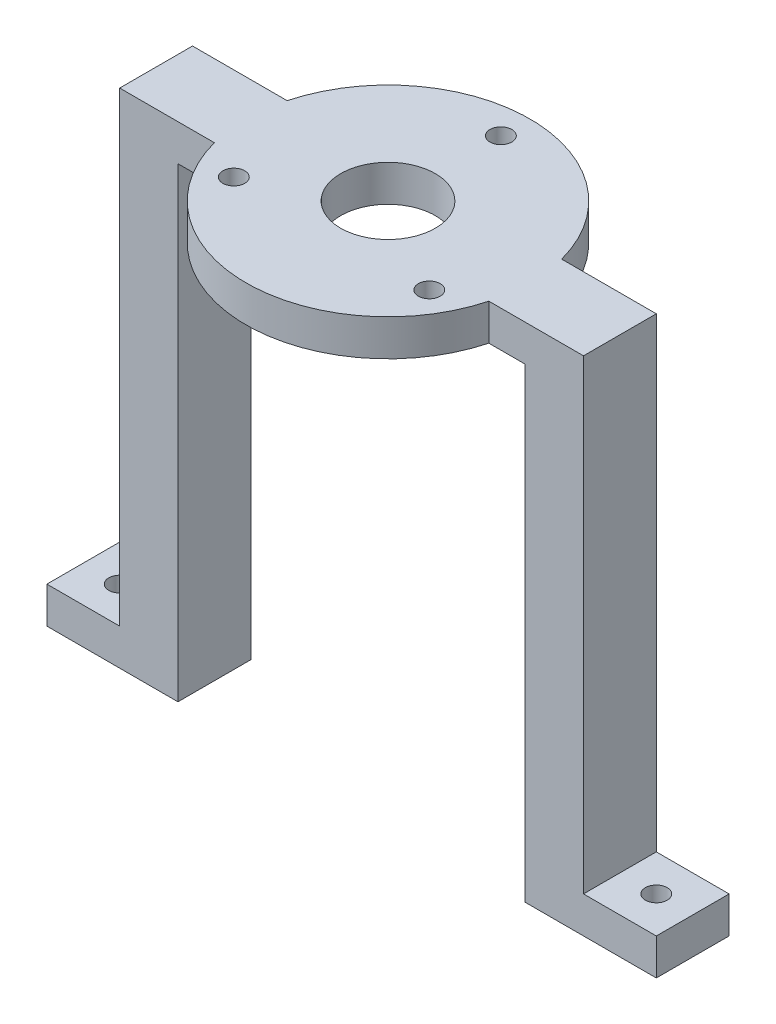
ISO-10303-21;
HEADER;
FILE_DESCRIPTION(('STEP AP214'),'2;1');
FILE_NAME('part.step','',(''),(''),'','','');
FILE_SCHEMA(('AUTOMOTIVE_DESIGN { 1 0 10303 214 1 1 1 1 }'));
ENDSEC;
DATA;
#1=APPLICATION_CONTEXT('core data for automotive mechanical design processes');
#2=APPLICATION_PROTOCOL_DEFINITION('international standard','automotive_design',2000,#1);
#3=PRODUCT_CONTEXT('',#1,'mechanical');
#4=PRODUCT('Part','Part','',(#3));
#5=PRODUCT_RELATED_PRODUCT_CATEGORY('part','',(#4));
#6=PRODUCT_DEFINITION_FORMATION('','',#4);
#7=PRODUCT_DEFINITION_CONTEXT('part definition',#1,'design');
#8=PRODUCT_DEFINITION('design','',#6,#7);
#9=PRODUCT_DEFINITION_SHAPE('','',#8);
#10=(LENGTH_UNIT() NAMED_UNIT(*) SI_UNIT(.MILLI.,.METRE.));
#11=(NAMED_UNIT(*) PLANE_ANGLE_UNIT() SI_UNIT($,.RADIAN.));
#12=(NAMED_UNIT(*) SI_UNIT($,.STERADIAN.) SOLID_ANGLE_UNIT());
#13=UNCERTAINTY_MEASURE_WITH_UNIT(LENGTH_MEASURE(1.E-05),#10,'distance_accuracy_value','');
#14=(GEOMETRIC_REPRESENTATION_CONTEXT(3) GLOBAL_UNCERTAINTY_ASSIGNED_CONTEXT((#13)) GLOBAL_UNIT_ASSIGNED_CONTEXT((#10,
#11,#12)) REPRESENTATION_CONTEXT('',''));
#15=CARTESIAN_POINT('',(0.,0.,0.));
#16=DIRECTION('',(0.,0.,1.));
#17=DIRECTION('',(1.,0.,0.));
#18=AXIS2_PLACEMENT_3D('',#15,#16,#17);
#19=CARTESIAN_POINT('',(31.8480768249708,5.,5.));
#20=DIRECTION('',(-1.,0.,0.));
#21=DIRECTION('',(0.,0.,1.));
#22=AXIS2_PLACEMENT_3D('',#19,#20,#21);
#23=PLANE('',#22);
#24=DIRECTION('',(0.,0.,1.));
#25=VECTOR('',#24,1.);
#26=CARTESIAN_POINT('',(31.8480768249708,-59.,5.));
#27=LINE('',#26,#25);
#28=CARTESIAN_POINT('',(31.8480768249708,-59.,-5.));
#29=VERTEX_POINT('',#28);
#30=CARTESIAN_POINT('',(31.8480768249708,-59.,5.));
#31=VERTEX_POINT('',#30);
#32=EDGE_CURVE('E55',#29,#31,#27,.T.);
#33=ORIENTED_EDGE('',*,*,#32,.F.);
#34=DIRECTION('',(0.,-1.,0.));
#35=VECTOR('',#34,1.);
#36=CARTESIAN_POINT('',(31.8480768249708,5.,-5.));
#37=LINE('',#36,#35);
#38=CARTESIAN_POINT('',(31.8480768249708,5.,-5.));
#39=VERTEX_POINT('',#38);
#40=EDGE_CURVE('E316',#39,#29,#37,.T.);
#41=ORIENTED_EDGE('',*,*,#40,.F.);
#42=DIRECTION('',(0.,0.,-1.));
#43=VECTOR('',#42,1.);
#44=CARTESIAN_POINT('',(31.8480768249708,5.,5.));
#45=LINE('',#44,#43);
#46=CARTESIAN_POINT('',(31.8480768249708,5.,5.));
#47=VERTEX_POINT('',#46);
#48=EDGE_CURVE('E288',#47,#39,#45,.T.);
#49=ORIENTED_EDGE('',*,*,#48,.F.);
#50=DIRECTION('',(0.,-1.,0.));
#51=VECTOR('',#50,1.);
#52=CARTESIAN_POINT('',(31.8480768249708,5.,5.));
#53=LINE('',#52,#51);
#54=EDGE_CURVE('E319',#47,#31,#53,.T.);
#55=ORIENTED_EDGE('',*,*,#54,.T.);
#56=EDGE_LOOP('',(#33,#41,#49,#55));
#57=FACE_BOUND('',#56,.T.);
#58=ADVANCED_FACE('F39',(#57),#23,.F.);
#59=CARTESIAN_POINT('',(-31.8480768249708,5.,5.));
#60=DIRECTION('',(1.,0.,0.));
#61=DIRECTION('',(0.,0.,-1.));
#62=AXIS2_PLACEMENT_3D('',#59,#60,#61);
#63=PLANE('',#62);
#64=DIRECTION('',(0.,0.,-1.));
#65=VECTOR('',#64,1.);
#66=CARTESIAN_POINT('',(-31.8480768249708,-59.,-5.));
#67=LINE('',#66,#65);
#68=CARTESIAN_POINT('',(-31.8480768249708,-59.,5.));
#69=VERTEX_POINT('',#68);
#70=CARTESIAN_POINT('',(-31.8480768249708,-59.,-5.));
#71=VERTEX_POINT('',#70);
#72=EDGE_CURVE('E63',#69,#71,#67,.T.);
#73=ORIENTED_EDGE('',*,*,#72,.F.);
#74=DIRECTION('',(0.,-1.,0.));
#75=VECTOR('',#74,1.);
#76=CARTESIAN_POINT('',(-31.8480768249708,5.,5.));
#77=LINE('',#76,#75);
#78=CARTESIAN_POINT('',(-31.8480768249708,5.,5.));
#79=VERTEX_POINT('',#78);
#80=EDGE_CURVE('E330',#79,#69,#77,.T.);
#81=ORIENTED_EDGE('',*,*,#80,.F.);
#82=DIRECTION('',(0.,0.,1.));
#83=VECTOR('',#82,1.);
#84=CARTESIAN_POINT('',(-31.8480768249708,5.,5.));
#85=LINE('',#84,#83);
#86=CARTESIAN_POINT('',(-31.8480768249708,5.,-5.));
#87=VERTEX_POINT('',#86);
#88=EDGE_CURVE('E276',#87,#79,#85,.T.);
#89=ORIENTED_EDGE('',*,*,#88,.F.);
#90=DIRECTION('',(0.,-1.,0.));
#91=VECTOR('',#90,1.);
#92=CARTESIAN_POINT('',(-31.8480768249708,5.,-5.));
#93=LINE('',#92,#91);
#94=EDGE_CURVE('E48',#87,#71,#93,.T.);
#95=ORIENTED_EDGE('',*,*,#94,.T.);
#96=EDGE_LOOP('',(#73,#81,#89,#95));
#97=FACE_BOUND('',#96,.T.);
#98=ADVANCED_FACE('F335',(#97),#63,.F.);
#99=CARTESIAN_POINT('',(0.,0.,0.));
#100=DIRECTION('',(0.,1.,0.));
#101=DIRECTION('',(0.,0.,1.));
#102=AXIS2_PLACEMENT_3D('',#99,#100,#101);
#103=PLANE('',#102);
#104=CARTESIAN_POINT('',(0.,0.,-15.5));
#105=DIRECTION('',(0.,1.,0.));
#106=DIRECTION('',(0.,0.,1.));
#107=AXIS2_PLACEMENT_3D('',#104,#105,#106);
#108=CIRCLE('',#107,1.49999999999999);
#109=CARTESIAN_POINT('',(0.,0.,-14.));
#110=VERTEX_POINT('',#109);
#111=EDGE_CURVE('E492',#110,#110,#108,.T.);
#112=ORIENTED_EDGE('',*,*,#111,.T.);
#113=EDGE_LOOP('',(#112));
#114=FACE_BOUND('',#113,.T.);
#115=CARTESIAN_POINT('',(13.4233937586598,0.,7.74999999999943));
#116=DIRECTION('',(0.,1.,0.));
#117=DIRECTION('',(0.,0.,1.));
#118=AXIS2_PLACEMENT_3D('',#115,#116,#117);
#119=CIRCLE('',#118,1.49999999999999);
#120=CARTESIAN_POINT('',(13.4233937586598,0.,9.24999999999942));
#121=VERTEX_POINT('',#120);
#122=EDGE_CURVE('E484',#121,#121,#119,.T.);
#123=ORIENTED_EDGE('',*,*,#122,.T.);
#124=EDGE_LOOP('',(#123));
#125=FACE_BOUND('',#124,.T.);
#126=CARTESIAN_POINT('',(-13.4233937586578,0.,7.75000000000057));
#127=DIRECTION('',(0.,1.,0.));
#128=DIRECTION('',(0.,0.,1.));
#129=AXIS2_PLACEMENT_3D('',#126,#127,#128);
#130=CIRCLE('',#129,1.49999999999999);
#131=CARTESIAN_POINT('',(-13.4233937586578,0.,9.25000000000055));
#132=VERTEX_POINT('',#131);
#133=EDGE_CURVE('E474',#132,#132,#130,.T.);
#134=ORIENTED_EDGE('',*,*,#133,.T.);
#135=EDGE_LOOP('',(#134));
#136=FACE_BOUND('',#135,.T.);
#137=CARTESIAN_POINT('',(0.,0.,0.));
#138=DIRECTION('',(0.,1.,0.));
#139=DIRECTION('',(0.,0.,1.));
#140=AXIS2_PLACEMENT_3D('',#137,#138,#139);
#141=CIRCLE('',#140,6.5);
#142=CARTESIAN_POINT('',(0.,0.,6.5));
#143=VERTEX_POINT('',#142);
#144=EDGE_CURVE('E259',#143,#143,#141,.T.);
#145=ORIENTED_EDGE('',*,*,#144,.T.);
#146=EDGE_LOOP('',(#145));
#147=FACE_BOUND('',#146,.T.);
#148=DIRECTION('',(0.,0.,-1.));
#149=VECTOR('',#148,1.);
#150=CARTESIAN_POINT('',(23.8480768249708,0.,5.));
#151=LINE('',#150,#149);
#152=CARTESIAN_POINT('',(23.8480768249708,0.,5.));
#153=VERTEX_POINT('',#152);
#154=CARTESIAN_POINT('',(23.8480768249708,0.,-5.));
#155=VERTEX_POINT('',#154);
#156=EDGE_CURVE('E167',#153,#155,#151,.T.);
#157=ORIENTED_EDGE('',*,*,#156,.F.);
#158=DIRECTION('',(1.,0.,0.));
#159=VECTOR('',#158,1.);
#160=CARTESIAN_POINT('',(31.8480768249708,0.,5.));
#161=LINE('',#160,#159);
#162=CARTESIAN_POINT('',(18.8480768249708,0.,5.00000000000001));
#163=VERTEX_POINT('',#162);
#164=EDGE_CURVE('E308',#163,#153,#161,.T.);
#165=ORIENTED_EDGE('',*,*,#164,.F.);
#166=CARTESIAN_POINT('',(0.,0.,0.));
#167=DIRECTION('',(0.,1.,0.));
#168=DIRECTION('',(0.,0.,1.));
#169=AXIS2_PLACEMENT_3D('',#166,#167,#168);
#170=CIRCLE('',#169,19.5);
#171=CARTESIAN_POINT('',(-18.8480768249708,0.,5.));
#172=VERTEX_POINT('',#171);
#173=EDGE_CURVE('E305',#172,#163,#170,.T.);
#174=ORIENTED_EDGE('',*,*,#173,.F.);
#175=DIRECTION('',(1.,0.,0.));
#176=VECTOR('',#175,1.);
#177=CARTESIAN_POINT('',(-31.8480768249708,0.,5.));
#178=LINE('',#177,#176);
#179=CARTESIAN_POINT('',(-23.8480768249708,0.,5.));
#180=VERTEX_POINT('',#179);
#181=EDGE_CURVE('E302',#180,#172,#178,.T.);
#182=ORIENTED_EDGE('',*,*,#181,.F.);
#183=DIRECTION('',(0.,0.,1.));
#184=VECTOR('',#183,1.);
#185=CARTESIAN_POINT('',(-23.8480768249708,0.,5.));
#186=LINE('',#185,#184);
#187=CARTESIAN_POINT('',(-23.8480768249708,0.,-5.));
#188=VERTEX_POINT('',#187);
#189=EDGE_CURVE('E238',#188,#180,#186,.T.);
#190=ORIENTED_EDGE('',*,*,#189,.F.);
#191=DIRECTION('',(-1.,0.,0.));
#192=VECTOR('',#191,1.);
#193=CARTESIAN_POINT('',(-31.8480768249708,0.,-5.));
#194=LINE('',#193,#192);
#195=CARTESIAN_POINT('',(-18.8480768249708,0.,-5.));
#196=VERTEX_POINT('',#195);
#197=EDGE_CURVE('E298',#196,#188,#194,.T.);
#198=ORIENTED_EDGE('',*,*,#197,.F.);
#199=CARTESIAN_POINT('',(0.,0.,0.));
#200=DIRECTION('',(0.,1.,0.));
#201=DIRECTION('',(0.,0.,1.));
#202=AXIS2_PLACEMENT_3D('',#199,#200,#201);
#203=CIRCLE('',#202,19.5);
#204=CARTESIAN_POINT('',(18.8480768249708,0.,-5.));
#205=VERTEX_POINT('',#204);
#206=EDGE_CURVE('E264',#205,#196,#203,.T.);
#207=ORIENTED_EDGE('',*,*,#206,.F.);
#208=DIRECTION('',(-1.,0.,0.));
#209=VECTOR('',#208,1.);
#210=CARTESIAN_POINT('',(31.8480768249708,0.,-5.));
#211=LINE('',#210,#209);
#212=EDGE_CURVE('E273',#155,#205,#211,.T.);
#213=ORIENTED_EDGE('',*,*,#212,.F.);
#214=EDGE_LOOP('',(#157,#165,#174,#182,#190,#198,#207,#213));
#215=FACE_BOUND('',#214,.T.);
#216=ADVANCED_FACE('F367',(#114,#125,#136,#147,#215),#103,.F.);
#217=CARTESIAN_POINT('',(0.,5.,0.));
#218=DIRECTION('',(0.,1.,0.));
#219=DIRECTION('',(0.,0.,1.));
#220=AXIS2_PLACEMENT_3D('',#217,#218,#219);
#221=PLANE('',#220);
#222=CARTESIAN_POINT('',(0.,5.,-15.5));
#223=DIRECTION('',(0.,1.,0.));
#224=DIRECTION('',(0.,0.,1.));
#225=AXIS2_PLACEMENT_3D('',#222,#223,#224);
#226=CIRCLE('',#225,1.49999999999999);
#227=CARTESIAN_POINT('',(0.,5.,-14.));
#228=VERTEX_POINT('',#227);
#229=EDGE_CURVE('E496',#228,#228,#226,.T.);
#230=ORIENTED_EDGE('',*,*,#229,.F.);
#231=EDGE_LOOP('',(#230));
#232=FACE_BOUND('',#231,.T.);
#233=CARTESIAN_POINT('',(13.4233937586598,5.,7.74999999999943));
#234=DIRECTION('',(0.,1.,0.));
#235=DIRECTION('',(0.,0.,1.));
#236=AXIS2_PLACEMENT_3D('',#233,#234,#235);
#237=CIRCLE('',#236,1.49999999999999);
#238=CARTESIAN_POINT('',(13.4233937586598,5.,9.24999999999942));
#239=VERTEX_POINT('',#238);
#240=EDGE_CURVE('E488',#239,#239,#237,.T.);
#241=ORIENTED_EDGE('',*,*,#240,.F.);
#242=EDGE_LOOP('',(#241));
#243=FACE_BOUND('',#242,.T.);
#244=CARTESIAN_POINT('',(-13.4233937586578,5.,7.75000000000057));
#245=DIRECTION('',(0.,1.,0.));
#246=DIRECTION('',(0.,0.,1.));
#247=AXIS2_PLACEMENT_3D('',#244,#245,#246);
#248=CIRCLE('',#247,1.49999999999999);
#249=CARTESIAN_POINT('',(-13.4233937586578,5.,9.25000000000055));
#250=VERTEX_POINT('',#249);
#251=EDGE_CURVE('E480',#250,#250,#248,.T.);
#252=ORIENTED_EDGE('',*,*,#251,.F.);
#253=EDGE_LOOP('',(#252));
#254=FACE_BOUND('',#253,.T.);
#255=CARTESIAN_POINT('',(0.,5.,0.));
#256=DIRECTION('',(0.,1.,0.));
#257=DIRECTION('',(0.,0.,1.));
#258=AXIS2_PLACEMENT_3D('',#255,#256,#257);
#259=CIRCLE('',#258,19.5);
#260=CARTESIAN_POINT('',(18.8480768249708,5.,-5.));
#261=VERTEX_POINT('',#260);
#262=CARTESIAN_POINT('',(-18.8480768249708,5.,-5.));
#263=VERTEX_POINT('',#262);
#264=EDGE_CURVE('E268',#261,#263,#259,.T.);
#265=ORIENTED_EDGE('',*,*,#264,.T.);
#266=DIRECTION('',(-1.,0.,0.));
#267=VECTOR('',#266,1.);
#268=CARTESIAN_POINT('',(-31.8480768249708,5.,-5.));
#269=LINE('',#268,#267);
#270=EDGE_CURVE('E272',#263,#87,#269,.T.);
#271=ORIENTED_EDGE('',*,*,#270,.T.);
#272=ORIENTED_EDGE('',*,*,#88,.T.);
#273=DIRECTION('',(1.,0.,0.));
#274=VECTOR('',#273,1.);
#275=CARTESIAN_POINT('',(-31.8480768249708,5.,5.));
#276=LINE('',#275,#274);
#277=CARTESIAN_POINT('',(-18.8480768249708,5.,5.));
#278=VERTEX_POINT('',#277);
#279=EDGE_CURVE('E279',#79,#278,#276,.T.);
#280=ORIENTED_EDGE('',*,*,#279,.T.);
#281=CARTESIAN_POINT('',(0.,5.,0.));
#282=DIRECTION('',(0.,1.,0.));
#283=DIRECTION('',(0.,0.,1.));
#284=AXIS2_PLACEMENT_3D('',#281,#282,#283);
#285=CIRCLE('',#284,19.5);
#286=CARTESIAN_POINT('',(18.8480768249708,5.,5.00000000000001));
#287=VERTEX_POINT('',#286);
#288=EDGE_CURVE('E282',#278,#287,#285,.T.);
#289=ORIENTED_EDGE('',*,*,#288,.T.);
#290=DIRECTION('',(1.,0.,0.));
#291=VECTOR('',#290,1.);
#292=CARTESIAN_POINT('',(31.8480768249708,5.,5.));
#293=LINE('',#292,#291);
#294=EDGE_CURVE('E285',#287,#47,#293,.T.);
#295=ORIENTED_EDGE('',*,*,#294,.T.);
#296=ORIENTED_EDGE('',*,*,#48,.T.);
#297=DIRECTION('',(-1.,0.,0.));
#298=VECTOR('',#297,1.);
#299=CARTESIAN_POINT('',(31.8480768249708,5.,-5.));
#300=LINE('',#299,#298);
#301=EDGE_CURVE('E291',#39,#261,#300,.T.);
#302=ORIENTED_EDGE('',*,*,#301,.T.);
#303=EDGE_LOOP('',(#265,#271,#272,#280,#289,#295,#296,#302));
#304=FACE_BOUND('',#303,.T.);
#305=CARTESIAN_POINT('',(0.,5.,0.));
#306=DIRECTION('',(0.,1.,0.));
#307=DIRECTION('',(0.,0.,1.));
#308=AXIS2_PLACEMENT_3D('',#305,#306,#307);
#309=CIRCLE('',#308,6.5);
#310=CARTESIAN_POINT('',(0.,5.,6.5));
#311=VERTEX_POINT('',#310);
#312=EDGE_CURVE('E260',#311,#311,#309,.T.);
#313=ORIENTED_EDGE('',*,*,#312,.F.);
#314=EDGE_LOOP('',(#313));
#315=FACE_BOUND('',#314,.T.);
#316=ADVANCED_FACE('F356',(#232,#243,#254,#304,#315),#221,.T.);
#317=CARTESIAN_POINT('',(0.,5.,0.));
#318=DIRECTION('',(0.,-1.,0.));
#319=DIRECTION('',(0.,0.,-1.));
#320=AXIS2_PLACEMENT_3D('',#317,#318,#319);
#321=CYLINDRICAL_SURFACE('',#320,19.5);
#322=ORIENTED_EDGE('',*,*,#206,.T.);
#323=DIRECTION('',(0.,-1.,0.));
#324=VECTOR('',#323,1.);
#325=CARTESIAN_POINT('',(-18.8480768249708,5.,-5.));
#326=LINE('',#325,#324);
#327=EDGE_CURVE('E11',#263,#196,#326,.T.);
#328=ORIENTED_EDGE('',*,*,#327,.F.);
#329=ORIENTED_EDGE('',*,*,#264,.F.);
#330=DIRECTION('',(0.,-1.,0.));
#331=VECTOR('',#330,1.);
#332=CARTESIAN_POINT('',(18.8480768249708,5.,-5.));
#333=LINE('',#332,#331);
#334=EDGE_CURVE('E294',#261,#205,#333,.T.);
#335=ORIENTED_EDGE('',*,*,#334,.T.);
#336=EDGE_LOOP('',(#322,#328,#329,#335));
#337=FACE_BOUND('',#336,.T.);
#338=ADVANCED_FACE('F41',(#337),#321,.T.);
#339=CARTESIAN_POINT('',(-31.8480768249708,5.,-5.));
#340=DIRECTION('',(0.,0.,1.));
#341=DIRECTION('',(1.,0.,0.));
#342=AXIS2_PLACEMENT_3D('',#339,#340,#341);
#343=PLANE('',#342);
#344=ORIENTED_EDGE('',*,*,#197,.T.);
#345=DIRECTION('',(0.,1.,0.));
#346=VECTOR('',#345,1.);
#347=CARTESIAN_POINT('',(-23.8480768249708,-64.,-5.));
#348=LINE('',#347,#346);
#349=CARTESIAN_POINT('',(-23.8480768249708,-64.,-5.));
#350=VERTEX_POINT('',#349);
#351=EDGE_CURVE('E255',#350,#188,#348,.T.);
#352=ORIENTED_EDGE('',*,*,#351,.F.);
#353=DIRECTION('',(1.,0.,0.));
#354=VECTOR('',#353,1.);
#355=CARTESIAN_POINT('',(-31.8480768249708,-64.,-5.));
#356=LINE('',#355,#354);
#357=CARTESIAN_POINT('',(-41.8480768249708,-64.,-4.99999999999999));
#358=VERTEX_POINT('',#357);
#359=EDGE_CURVE('E239',#358,#350,#356,.T.);
#360=ORIENTED_EDGE('',*,*,#359,.F.);
#361=DIRECTION('',(0.,-1.,0.));
#362=VECTOR('',#361,1.);
#363=CARTESIAN_POINT('',(-41.8480768249708,-59.,-5.));
#364=LINE('',#363,#362);
#365=CARTESIAN_POINT('',(-41.8480768249708,-59.,-5.));
#366=VERTEX_POINT('',#365);
#367=EDGE_CURVE('E202',#366,#358,#364,.T.);
#368=ORIENTED_EDGE('',*,*,#367,.F.);
#369=DIRECTION('',(1.,0.,0.));
#370=VECTOR('',#369,1.);
#371=CARTESIAN_POINT('',(-41.8480768249708,-59.,-5.));
#372=LINE('',#371,#370);
#373=EDGE_CURVE('E216',#366,#71,#372,.T.);
#374=ORIENTED_EDGE('',*,*,#373,.T.);
#375=ORIENTED_EDGE('',*,*,#94,.F.);
#376=ORIENTED_EDGE('',*,*,#270,.F.);
#377=ORIENTED_EDGE('',*,*,#327,.T.);
#378=EDGE_LOOP('',(#344,#352,#360,#368,#374,#375,#376,#377));
#379=FACE_BOUND('',#378,.T.);
#380=ADVANCED_FACE('F343',(#379),#343,.F.);
#381=CARTESIAN_POINT('',(-31.8480768249708,5.,5.));
#382=DIRECTION('',(0.,0.,-1.));
#383=DIRECTION('',(-1.,0.,0.));
#384=AXIS2_PLACEMENT_3D('',#381,#382,#383);
#385=PLANE('',#384);
#386=ORIENTED_EDGE('',*,*,#80,.T.);
#387=DIRECTION('',(1.,0.,0.));
#388=VECTOR('',#387,1.);
#389=CARTESIAN_POINT('',(-41.8480768249708,-59.,5.));
#390=LINE('',#389,#388);
#391=CARTESIAN_POINT('',(-41.8480768249708,-59.,5.));
#392=VERTEX_POINT('',#391);
#393=EDGE_CURVE('E222',#392,#69,#390,.T.);
#394=ORIENTED_EDGE('',*,*,#393,.F.);
#395=DIRECTION('',(0.,1.,0.));
#396=VECTOR('',#395,1.);
#397=CARTESIAN_POINT('',(-41.8480768249708,-59.,5.));
#398=LINE('',#397,#396);
#399=CARTESIAN_POINT('',(-41.8480768249708,-64.,5.00000000000001));
#400=VERTEX_POINT('',#399);
#401=EDGE_CURVE('E210',#400,#392,#398,.T.);
#402=ORIENTED_EDGE('',*,*,#401,.F.);
#403=DIRECTION('',(-1.,0.,0.));
#404=VECTOR('',#403,1.);
#405=CARTESIAN_POINT('',(-31.8480768249708,-64.,5.));
#406=LINE('',#405,#404);
#407=CARTESIAN_POINT('',(-23.8480768249708,-64.,5.));
#408=VERTEX_POINT('',#407);
#409=EDGE_CURVE('E245',#408,#400,#406,.T.);
#410=ORIENTED_EDGE('',*,*,#409,.F.);
#411=DIRECTION('',(0.,1.,0.));
#412=VECTOR('',#411,1.);
#413=CARTESIAN_POINT('',(-23.8480768249708,-64.,5.));
#414=LINE('',#413,#412);
#415=EDGE_CURVE('E248',#408,#180,#414,.T.);
#416=ORIENTED_EDGE('',*,*,#415,.T.);
#417=ORIENTED_EDGE('',*,*,#181,.T.);
#418=DIRECTION('',(0.,-1.,0.));
#419=VECTOR('',#418,1.);
#420=CARTESIAN_POINT('',(-18.8480768249708,5.,5.));
#421=LINE('',#420,#419);
#422=EDGE_CURVE('E326',#278,#172,#421,.T.);
#423=ORIENTED_EDGE('',*,*,#422,.F.);
#424=ORIENTED_EDGE('',*,*,#279,.F.);
#425=EDGE_LOOP('',(#386,#394,#402,#410,#416,#417,#423,#424));
#426=FACE_BOUND('',#425,.T.);
#427=ADVANCED_FACE('F351',(#426),#385,.F.);
#428=CARTESIAN_POINT('',(0.,5.,0.));
#429=DIRECTION('',(0.,-1.,0.));
#430=DIRECTION('',(0.,0.,-1.));
#431=AXIS2_PLACEMENT_3D('',#428,#429,#430);
#432=CYLINDRICAL_SURFACE('',#431,19.5);
#433=ORIENTED_EDGE('',*,*,#173,.T.);
#434=DIRECTION('',(0.,-1.,0.));
#435=VECTOR('',#434,1.);
#436=CARTESIAN_POINT('',(18.8480768249708,5.,5.00000000000001));
#437=LINE('',#436,#435);
#438=EDGE_CURVE('E322',#287,#163,#437,.T.);
#439=ORIENTED_EDGE('',*,*,#438,.F.);
#440=ORIENTED_EDGE('',*,*,#288,.F.);
#441=ORIENTED_EDGE('',*,*,#422,.T.);
#442=EDGE_LOOP('',(#433,#439,#440,#441));
#443=FACE_BOUND('',#442,.T.);
#444=ADVANCED_FACE('F400',(#443),#432,.T.);
#445=CARTESIAN_POINT('',(31.8480768249708,5.,5.));
#446=DIRECTION('',(0.,0.,-1.));
#447=DIRECTION('',(-1.,0.,0.));
#448=AXIS2_PLACEMENT_3D('',#445,#446,#447);
#449=PLANE('',#448);
#450=ORIENTED_EDGE('',*,*,#164,.T.);
#451=DIRECTION('',(0.,1.,0.));
#452=VECTOR('',#451,1.);
#453=CARTESIAN_POINT('',(23.8480768249708,-64.,5.));
#454=LINE('',#453,#452);
#455=CARTESIAN_POINT('',(23.8480768249708,-64.,5.));
#456=VERTEX_POINT('',#455);
#457=EDGE_CURVE('E162',#456,#153,#454,.T.);
#458=ORIENTED_EDGE('',*,*,#457,.F.);
#459=DIRECTION('',(-1.,0.,0.));
#460=VECTOR('',#459,1.);
#461=CARTESIAN_POINT('',(31.8480768249708,-64.,5.));
#462=LINE('',#461,#460);
#463=CARTESIAN_POINT('',(41.8480768249708,-64.,5.00000000000001));
#464=VERTEX_POINT('',#463);
#465=EDGE_CURVE('E155',#464,#456,#462,.T.);
#466=ORIENTED_EDGE('',*,*,#465,.F.);
#467=DIRECTION('',(0.,-1.,0.));
#468=VECTOR('',#467,1.);
#469=CARTESIAN_POINT('',(41.8480768249708,-64.,5.00000000000001));
#470=LINE('',#469,#468);
#471=CARTESIAN_POINT('',(41.8480768249708,-59.,5.));
#472=VERTEX_POINT('',#471);
#473=EDGE_CURVE('E161',#472,#464,#470,.T.);
#474=ORIENTED_EDGE('',*,*,#473,.F.);
#475=DIRECTION('',(-1.,0.,0.));
#476=VECTOR('',#475,1.);
#477=CARTESIAN_POINT('',(41.8480768249708,-59.,5.));
#478=LINE('',#477,#476);
#479=EDGE_CURVE('E194',#472,#31,#478,.T.);
#480=ORIENTED_EDGE('',*,*,#479,.T.);
#481=ORIENTED_EDGE('',*,*,#54,.F.);
#482=ORIENTED_EDGE('',*,*,#294,.F.);
#483=ORIENTED_EDGE('',*,*,#438,.T.);
#484=EDGE_LOOP('',(#450,#458,#466,#474,#480,#481,#482,#483));
#485=FACE_BOUND('',#484,.T.);
#486=ADVANCED_FACE('F158',(#485),#449,.F.);
#487=CARTESIAN_POINT('',(31.8480768249708,5.,-5.));
#488=DIRECTION('',(0.,0.,1.));
#489=DIRECTION('',(1.,0.,0.));
#490=AXIS2_PLACEMENT_3D('',#487,#488,#489);
#491=PLANE('',#490);
#492=ORIENTED_EDGE('',*,*,#40,.T.);
#493=DIRECTION('',(-1.,0.,0.));
#494=VECTOR('',#493,1.);
#495=CARTESIAN_POINT('',(41.8480768249708,-59.,-5.));
#496=LINE('',#495,#494);
#497=CARTESIAN_POINT('',(41.8480768249708,-59.,-5.));
#498=VERTEX_POINT('',#497);
#499=EDGE_CURVE('E198',#498,#29,#496,.T.);
#500=ORIENTED_EDGE('',*,*,#499,.F.);
#501=DIRECTION('',(0.,1.,0.));
#502=VECTOR('',#501,1.);
#503=CARTESIAN_POINT('',(41.8480768249708,-64.,-4.99999999999999));
#504=LINE('',#503,#502);
#505=CARTESIAN_POINT('',(41.8480768249708,-64.,-4.99999999999999));
#506=VERTEX_POINT('',#505);
#507=EDGE_CURVE('E177',#506,#498,#504,.T.);
#508=ORIENTED_EDGE('',*,*,#507,.F.);
#509=DIRECTION('',(1.,0.,0.));
#510=VECTOR('',#509,1.);
#511=CARTESIAN_POINT('',(31.8480768249708,-64.,-5.));
#512=LINE('',#511,#510);
#513=CARTESIAN_POINT('',(23.8480768249708,-64.,-5.));
#514=VERTEX_POINT('',#513);
#515=EDGE_CURVE('E173',#514,#506,#512,.T.);
#516=ORIENTED_EDGE('',*,*,#515,.F.);
#517=DIRECTION('',(0.,1.,0.));
#518=VECTOR('',#517,1.);
#519=CARTESIAN_POINT('',(23.8480768249708,-64.,-5.));
#520=LINE('',#519,#518);
#521=EDGE_CURVE('E230',#514,#155,#520,.T.);
#522=ORIENTED_EDGE('',*,*,#521,.T.);
#523=ORIENTED_EDGE('',*,*,#212,.T.);
#524=ORIENTED_EDGE('',*,*,#334,.F.);
#525=ORIENTED_EDGE('',*,*,#301,.F.);
#526=EDGE_LOOP('',(#492,#500,#508,#516,#522,#523,#524,#525));
#527=FACE_BOUND('',#526,.T.);
#528=ADVANCED_FACE('F396',(#527),#491,.F.);
#529=CARTESIAN_POINT('',(0.,5.,0.));
#530=DIRECTION('',(0.,-1.,0.));
#531=DIRECTION('',(0.,0.,-1.));
#532=AXIS2_PLACEMENT_3D('',#529,#530,#531);
#533=CYLINDRICAL_SURFACE('',#532,6.5);
#534=ORIENTED_EDGE('',*,*,#312,.T.);
#535=EDGE_LOOP('',(#534));
#536=FACE_BOUND('',#535,.T.);
#537=ORIENTED_EDGE('',*,*,#144,.F.);
#538=EDGE_LOOP('',(#537));
#539=FACE_BOUND('',#538,.T.);
#540=ADVANCED_FACE('F385',(#536,#539),#533,.F.);
#541=CARTESIAN_POINT('',(-23.8480768249708,-64.,5.));
#542=DIRECTION('',(-1.,0.,0.));
#543=DIRECTION('',(0.,0.,1.));
#544=AXIS2_PLACEMENT_3D('',#541,#542,#543);
#545=PLANE('',#544);
#546=ORIENTED_EDGE('',*,*,#189,.T.);
#547=ORIENTED_EDGE('',*,*,#415,.F.);
#548=DIRECTION('',(0.,0.,1.));
#549=VECTOR('',#548,1.);
#550=CARTESIAN_POINT('',(-23.8480768249708,-64.,5.));
#551=LINE('',#550,#549);
#552=EDGE_CURVE('E242',#350,#408,#551,.T.);
#553=ORIENTED_EDGE('',*,*,#552,.F.);
#554=ORIENTED_EDGE('',*,*,#351,.T.);
#555=EDGE_LOOP('',(#546,#547,#553,#554));
#556=FACE_BOUND('',#555,.T.);
#557=ADVANCED_FACE('F371',(#556),#545,.F.);
#558=CARTESIAN_POINT('',(0.,-64.,0.));
#559=DIRECTION('',(0.,-1.,0.));
#560=DIRECTION('',(0.,0.,-1.));
#561=AXIS2_PLACEMENT_3D('',#558,#559,#560);
#562=PLANE('',#561);
#563=CARTESIAN_POINT('',(-36.8480768249708,-64.,0.));
#564=DIRECTION('',(0.,-1.,0.));
#565=DIRECTION('',(0.,0.,-1.));
#566=AXIS2_PLACEMENT_3D('',#563,#564,#565);
#567=CIRCLE('',#566,1.49999999999999);
#568=CARTESIAN_POINT('',(-36.8480768249708,-64.,-1.49999999999999));
#569=VERTEX_POINT('',#568);
#570=EDGE_CURVE('E186',#569,#569,#567,.T.);
#571=ORIENTED_EDGE('',*,*,#570,.F.);
#572=EDGE_LOOP('',(#571));
#573=FACE_BOUND('',#572,.T.);
#574=ORIENTED_EDGE('',*,*,#409,.T.);
#575=DIRECTION('',(0.,0.,1.));
#576=VECTOR('',#575,1.);
#577=CARTESIAN_POINT('',(-41.8480768249708,-64.,-4.99999999999999));
#578=LINE('',#577,#576);
#579=EDGE_CURVE('E206',#358,#400,#578,.T.);
#580=ORIENTED_EDGE('',*,*,#579,.F.);
#581=ORIENTED_EDGE('',*,*,#359,.T.);
#582=ORIENTED_EDGE('',*,*,#552,.T.);
#583=EDGE_LOOP('',(#574,#580,#581,#582));
#584=FACE_BOUND('',#583,.T.);
#585=ADVANCED_FACE('F374',(#573,#584),#562,.T.);
#586=CARTESIAN_POINT('',(23.8480768249708,-64.,5.));
#587=DIRECTION('',(1.,0.,0.));
#588=DIRECTION('',(0.,0.,-1.));
#589=AXIS2_PLACEMENT_3D('',#586,#587,#588);
#590=PLANE('',#589);
#591=ORIENTED_EDGE('',*,*,#156,.T.);
#592=ORIENTED_EDGE('',*,*,#521,.F.);
#593=DIRECTION('',(0.,0.,-1.));
#594=VECTOR('',#593,1.);
#595=CARTESIAN_POINT('',(23.8480768249708,-64.,5.));
#596=LINE('',#595,#594);
#597=EDGE_CURVE('E166',#456,#514,#596,.T.);
#598=ORIENTED_EDGE('',*,*,#597,.F.);
#599=ORIENTED_EDGE('',*,*,#457,.T.);
#600=EDGE_LOOP('',(#591,#592,#598,#599));
#601=FACE_BOUND('',#600,.T.);
#602=ADVANCED_FACE('F376',(#601),#590,.F.);
#603=CARTESIAN_POINT('',(0.,-64.,0.));
#604=DIRECTION('',(0.,1.,0.));
#605=DIRECTION('',(0.,0.,1.));
#606=AXIS2_PLACEMENT_3D('',#603,#604,#605);
#607=PLANE('',#606);
#608=CARTESIAN_POINT('',(36.8480768249708,-64.,0.));
#609=DIRECTION('',(0.,1.,0.));
#610=DIRECTION('',(0.,0.,1.));
#611=AXIS2_PLACEMENT_3D('',#608,#609,#610);
#612=CIRCLE('',#611,1.49999999999999);
#613=CARTESIAN_POINT('',(36.8480768249708,-64.,1.49999999999999));
#614=VERTEX_POINT('',#613);
#615=EDGE_CURVE('E464',#614,#614,#612,.T.);
#616=ORIENTED_EDGE('',*,*,#615,.T.);
#617=EDGE_LOOP('',(#616));
#618=FACE_BOUND('',#617,.T.);
#619=ORIENTED_EDGE('',*,*,#515,.T.);
#620=DIRECTION('',(0.,0.,-1.));
#621=VECTOR('',#620,1.);
#622=CARTESIAN_POINT('',(41.8480768249708,-64.,5.00000000000001));
#623=LINE('',#622,#621);
#624=EDGE_CURVE('E170',#464,#506,#623,.T.);
#625=ORIENTED_EDGE('',*,*,#624,.F.);
#626=ORIENTED_EDGE('',*,*,#465,.T.);
#627=ORIENTED_EDGE('',*,*,#597,.T.);
#628=EDGE_LOOP('',(#619,#625,#626,#627));
#629=FACE_BOUND('',#628,.T.);
#630=ADVANCED_FACE('F171',(#618,#629),#607,.F.);
#631=CARTESIAN_POINT('',(-41.8480768249708,-59.,-5.));
#632=DIRECTION('',(0.,-1.,0.));
#633=DIRECTION('',(0.,0.,-1.));
#634=AXIS2_PLACEMENT_3D('',#631,#632,#633);
#635=PLANE('',#634);
#636=CARTESIAN_POINT('',(-36.8480768249708,-59.,0.));
#637=DIRECTION('',(0.,1.,0.));
#638=DIRECTION('',(0.,0.,1.));
#639=AXIS2_PLACEMENT_3D('',#636,#637,#638);
#640=CIRCLE('',#639,1.49999999999999);
#641=CARTESIAN_POINT('',(-36.8480768249708,-59.,1.49999999999999));
#642=VERTEX_POINT('',#641);
#643=EDGE_CURVE('E467',#642,#642,#640,.T.);
#644=ORIENTED_EDGE('',*,*,#643,.F.);
#645=EDGE_LOOP('',(#644));
#646=FACE_BOUND('',#645,.T.);
#647=ORIENTED_EDGE('',*,*,#72,.T.);
#648=ORIENTED_EDGE('',*,*,#373,.F.);
#649=DIRECTION('',(0.,0.,-1.));
#650=VECTOR('',#649,1.);
#651=CARTESIAN_POINT('',(-41.8480768249708,-59.,-5.));
#652=LINE('',#651,#650);
#653=EDGE_CURVE('E213',#392,#366,#652,.T.);
#654=ORIENTED_EDGE('',*,*,#653,.F.);
#655=ORIENTED_EDGE('',*,*,#393,.T.);
#656=EDGE_LOOP('',(#647,#648,#654,#655));
#657=FACE_BOUND('',#656,.T.);
#658=ADVANCED_FACE('F339',(#646,#657),#635,.F.);
#659=CARTESIAN_POINT('',(-41.8480768249708,0.,0.));
#660=DIRECTION('',(-1.,0.,0.));
#661=DIRECTION('',(0.,0.,1.));
#662=AXIS2_PLACEMENT_3D('',#659,#660,#661);
#663=PLANE('',#662);
#664=ORIENTED_EDGE('',*,*,#367,.T.);
#665=ORIENTED_EDGE('',*,*,#579,.T.);
#666=ORIENTED_EDGE('',*,*,#401,.T.);
#667=ORIENTED_EDGE('',*,*,#653,.T.);
#668=EDGE_LOOP('',(#664,#665,#666,#667));
#669=FACE_BOUND('',#668,.T.);
#670=ADVANCED_FACE('F347',(#669),#663,.T.);
#671=CARTESIAN_POINT('',(41.8480768249708,-59.,5.));
#672=DIRECTION('',(0.,-1.,0.));
#673=DIRECTION('',(0.,0.,-1.));
#674=AXIS2_PLACEMENT_3D('',#671,#672,#673);
#675=PLANE('',#674);
#676=CARTESIAN_POINT('',(36.8480768249708,-59.,0.));
#677=DIRECTION('',(0.,1.,0.));
#678=DIRECTION('',(0.,0.,1.));
#679=AXIS2_PLACEMENT_3D('',#676,#677,#678);
#680=CIRCLE('',#679,1.49999999999999);
#681=CARTESIAN_POINT('',(36.8480768249708,-59.,1.49999999999999));
#682=VERTEX_POINT('',#681);
#683=EDGE_CURVE('E468',#682,#682,#680,.T.);
#684=ORIENTED_EDGE('',*,*,#683,.F.);
#685=EDGE_LOOP('',(#684));
#686=FACE_BOUND('',#685,.T.);
#687=ORIENTED_EDGE('',*,*,#32,.T.);
#688=ORIENTED_EDGE('',*,*,#479,.F.);
#689=DIRECTION('',(0.,0.,1.));
#690=VECTOR('',#689,1.);
#691=CARTESIAN_POINT('',(41.8480768249708,-59.,5.));
#692=LINE('',#691,#690);
#693=EDGE_CURVE('E181',#498,#472,#692,.T.);
#694=ORIENTED_EDGE('',*,*,#693,.F.);
#695=ORIENTED_EDGE('',*,*,#499,.T.);
#696=EDGE_LOOP('',(#687,#688,#694,#695));
#697=FACE_BOUND('',#696,.T.);
#698=ADVANCED_FACE('F437',(#686,#697),#675,.F.);
#699=CARTESIAN_POINT('',(41.8480768249708,0.,0.));
#700=DIRECTION('',(-1.,0.,0.));
#701=DIRECTION('',(0.,0.,1.));
#702=AXIS2_PLACEMENT_3D('',#699,#700,#701);
#703=PLANE('',#702);
#704=ORIENTED_EDGE('',*,*,#473,.T.);
#705=ORIENTED_EDGE('',*,*,#624,.T.);
#706=ORIENTED_EDGE('',*,*,#507,.T.);
#707=ORIENTED_EDGE('',*,*,#693,.T.);
#708=EDGE_LOOP('',(#704,#705,#706,#707));
#709=FACE_BOUND('',#708,.T.);
#710=ADVANCED_FACE('F179',(#709),#703,.F.);
#711=CARTESIAN_POINT('',(-36.8480768249708,-59.,0.));
#712=DIRECTION('',(0.,1.,0.));
#713=DIRECTION('',(0.,0.,1.));
#714=AXIS2_PLACEMENT_3D('',#711,#712,#713);
#715=CYLINDRICAL_SURFACE('',#714,1.49999999999999);
#716=ORIENTED_EDGE('',*,*,#570,.T.);
#717=EDGE_LOOP('',(#716));
#718=FACE_BOUND('',#717,.T.);
#719=ORIENTED_EDGE('',*,*,#643,.T.);
#720=EDGE_LOOP('',(#719));
#721=FACE_BOUND('',#720,.T.);
#722=ADVANCED_FACE('F449',(#718,#721),#715,.F.);
#723=CARTESIAN_POINT('',(36.8480768249708,-59.,0.));
#724=DIRECTION('',(0.,1.,0.));
#725=DIRECTION('',(0.,0.,1.));
#726=AXIS2_PLACEMENT_3D('',#723,#724,#725);
#727=CYLINDRICAL_SURFACE('',#726,1.49999999999999);
#728=ORIENTED_EDGE('',*,*,#683,.T.);
#729=EDGE_LOOP('',(#728));
#730=FACE_BOUND('',#729,.T.);
#731=ORIENTED_EDGE('',*,*,#615,.F.);
#732=EDGE_LOOP('',(#731));
#733=FACE_BOUND('',#732,.T.);
#734=ADVANCED_FACE('F513',(#730,#733),#727,.F.);
#735=CARTESIAN_POINT('',(-13.4233937586578,5.,7.75000000000057));
#736=DIRECTION('',(0.,1.,0.));
#737=DIRECTION('',(0.,0.,1.));
#738=AXIS2_PLACEMENT_3D('',#735,#736,#737);
#739=CYLINDRICAL_SURFACE('',#738,1.49999999999999);
#740=ORIENTED_EDGE('',*,*,#251,.T.);
#741=EDGE_LOOP('',(#740));
#742=FACE_BOUND('',#741,.T.);
#743=ORIENTED_EDGE('',*,*,#133,.F.);
#744=EDGE_LOOP('',(#743));
#745=FACE_BOUND('',#744,.T.);
#746=ADVANCED_FACE('F511',(#742,#745),#739,.F.);
#747=CARTESIAN_POINT('',(13.4233937586598,5.,7.74999999999943));
#748=DIRECTION('',(0.,1.,0.));
#749=DIRECTION('',(0.,0.,1.));
#750=AXIS2_PLACEMENT_3D('',#747,#748,#749);
#751=CYLINDRICAL_SURFACE('',#750,1.49999999999999);
#752=ORIENTED_EDGE('',*,*,#240,.T.);
#753=EDGE_LOOP('',(#752));
#754=FACE_BOUND('',#753,.T.);
#755=ORIENTED_EDGE('',*,*,#122,.F.);
#756=EDGE_LOOP('',(#755));
#757=FACE_BOUND('',#756,.T.);
#758=ADVANCED_FACE('F503',(#754,#757),#751,.F.);
#759=CARTESIAN_POINT('',(0.,5.,-15.5));
#760=DIRECTION('',(0.,1.,0.));
#761=DIRECTION('',(0.,0.,1.));
#762=AXIS2_PLACEMENT_3D('',#759,#760,#761);
#763=CYLINDRICAL_SURFACE('',#762,1.49999999999999);
#764=ORIENTED_EDGE('',*,*,#229,.T.);
#765=EDGE_LOOP('',(#764));
#766=FACE_BOUND('',#765,.T.);
#767=ORIENTED_EDGE('',*,*,#111,.F.);
#768=EDGE_LOOP('',(#767));
#769=FACE_BOUND('',#768,.T.);
#770=ADVANCED_FACE('F500',(#766,#769),#763,.F.);
#771=CLOSED_SHELL('',(#58,#98,#216,#316,#338,#380,#427,#444,#486,#528,#540,#557,#585,#602,#630,
#658,#670,#698,#710,#722,#734,#746,#758,#770));
#772=MANIFOLD_SOLID_BREP('B2',#771);
#773=ADVANCED_BREP_SHAPE_REPRESENTATION('',(#18,#772),#14);
#774=SHAPE_DEFINITION_REPRESENTATION(#9,#773);
ENDSEC;
END-ISO-10303-21;
